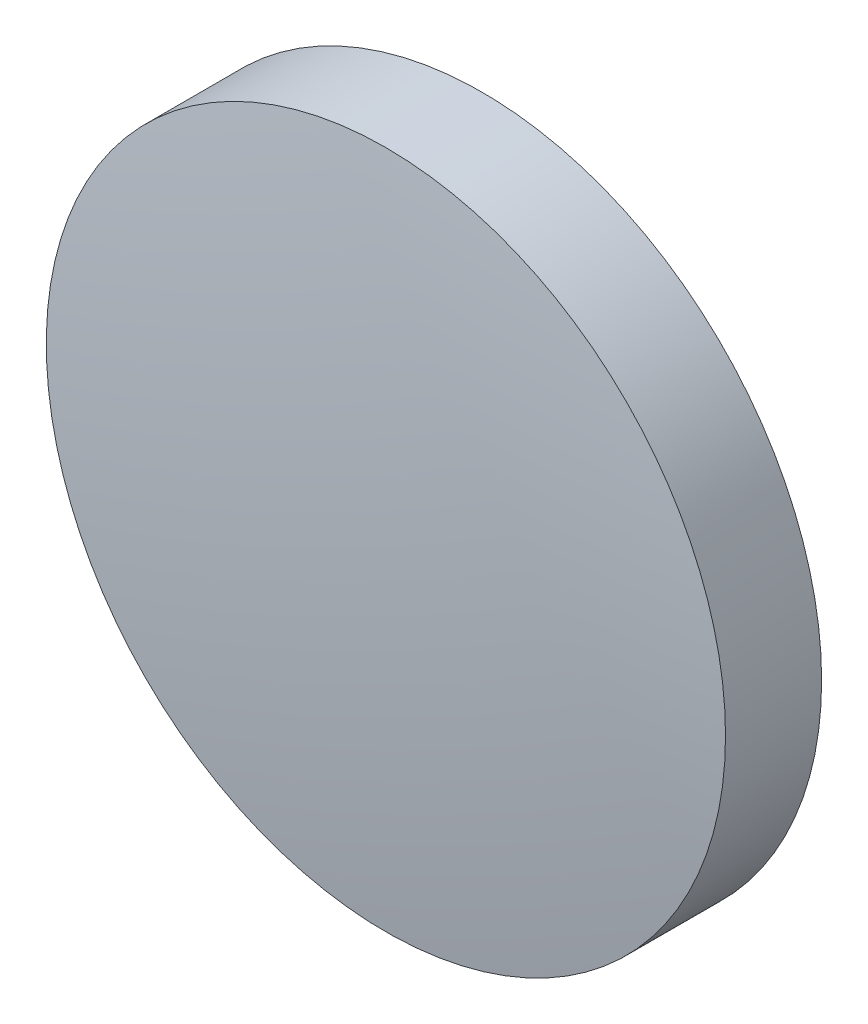
ISO-10303-21;
HEADER;
FILE_DESCRIPTION(('STEP AP214'),'2;1');
FILE_NAME('part.step','',(''),(''),'','','');
FILE_SCHEMA(('AUTOMOTIVE_DESIGN { 1 0 10303 214 1 1 1 1 }'));
ENDSEC;
DATA;
#1=APPLICATION_CONTEXT('core data for automotive mechanical design processes');
#2=APPLICATION_PROTOCOL_DEFINITION('international standard','automotive_design',2000,#1);
#3=PRODUCT_CONTEXT('',#1,'mechanical');
#4=PRODUCT('Part','Part','',(#3));
#5=PRODUCT_RELATED_PRODUCT_CATEGORY('part','',(#4));
#6=PRODUCT_DEFINITION_FORMATION('','',#4);
#7=PRODUCT_DEFINITION_CONTEXT('part definition',#1,'design');
#8=PRODUCT_DEFINITION('design','',#6,#7);
#9=PRODUCT_DEFINITION_SHAPE('','',#8);
#10=(LENGTH_UNIT() NAMED_UNIT(*) SI_UNIT(.MILLI.,.METRE.));
#11=(NAMED_UNIT(*) PLANE_ANGLE_UNIT() SI_UNIT($,.RADIAN.));
#12=(NAMED_UNIT(*) SI_UNIT($,.STERADIAN.) SOLID_ANGLE_UNIT());
#13=UNCERTAINTY_MEASURE_WITH_UNIT(LENGTH_MEASURE(1.E-05),#10,'distance_accuracy_value','');
#14=(GEOMETRIC_REPRESENTATION_CONTEXT(3) GLOBAL_UNCERTAINTY_ASSIGNED_CONTEXT((#13)) GLOBAL_UNIT_ASSIGNED_CONTEXT((#10,
#11,#12)) REPRESENTATION_CONTEXT('',''));
#15=CARTESIAN_POINT('',(0.,0.,0.));
#16=DIRECTION('',(0.,0.,1.));
#17=DIRECTION('',(1.,0.,0.));
#18=AXIS2_PLACEMENT_3D('',#15,#16,#17);
#19=CARTESIAN_POINT('',(0.,0.,-50.405));
#20=DIRECTION('',(0.,0.,1.));
#21=DIRECTION('',(0.,1.,0.));
#22=AXIS2_PLACEMENT_3D('',#19,#20,#21);
#23=SPHERICAL_SURFACE('',#22,51.5);
#24=CARTESIAN_POINT('',(0.,0.,0.702020065740479));
#25=DIRECTION('',(0.,0.,1.));
#26=DIRECTION('',(1.,0.,0.));
#27=AXIS2_PLACEMENT_3D('',#24,#25,#26);
#28=CIRCLE('',#27,6.35);
#29=CARTESIAN_POINT('',(6.35,0.,0.702020065740479));
#30=VERTEX_POINT('',#29);
#31=EDGE_CURVE('E8',#30,#30,#28,.T.);
#32=ORIENTED_EDGE('',*,*,#31,.T.);
#33=EDGE_LOOP('',(#32));
#34=FACE_BOUND('',#33,.T.);
#35=ADVANCED_FACE('F12',(#34),#23,.T.);
#36=CARTESIAN_POINT('',(0.,0.,4.30813204540037));
#37=DIRECTION('',(0.,0.,1.));
#38=DIRECTION('',(1.,0.,0.));
#39=AXIS2_PLACEMENT_3D('',#36,#37,#38);
#40=CYLINDRICAL_SURFACE('',#39,6.35);
#41=ORIENTED_EDGE('',*,*,#31,.F.);
#42=EDGE_LOOP('',(#41));
#43=FACE_BOUND('',#42,.T.);
#44=CARTESIAN_POINT('',(0.,0.,-1.095));
#45=DIRECTION('',(0.,0.,1.));
#46=DIRECTION('',(1.,0.,0.));
#47=AXIS2_PLACEMENT_3D('',#44,#45,#46);
#48=CIRCLE('',#47,6.35);
#49=CARTESIAN_POINT('',(6.35,0.,-1.095));
#50=VERTEX_POINT('',#49);
#51=EDGE_CURVE('E18',#50,#50,#48,.T.);
#52=ORIENTED_EDGE('',*,*,#51,.T.);
#53=EDGE_LOOP('',(#52));
#54=FACE_BOUND('',#53,.T.);
#55=ADVANCED_FACE('F24',(#43,#54),#40,.T.);
#56=CARTESIAN_POINT('',(0.,0.,-1.095));
#57=DIRECTION('',(0.,0.,1.));
#58=DIRECTION('',(1.,0.,0.));
#59=AXIS2_PLACEMENT_3D('',#56,#57,#58);
#60=PLANE('',#59);
#61=ORIENTED_EDGE('',*,*,#51,.F.);
#62=EDGE_LOOP('',(#61));
#63=FACE_BOUND('',#62,.T.);
#64=ADVANCED_FACE('F26',(#63),#60,.F.);
#65=CLOSED_SHELL('',(#35,#55,#64));
#66=MANIFOLD_SOLID_BREP('B1',#65);
#67=ADVANCED_BREP_SHAPE_REPRESENTATION('',(#18,#66),#14);
#68=SHAPE_DEFINITION_REPRESENTATION(#9,#67);
ENDSEC;
END-ISO-10303-21;
